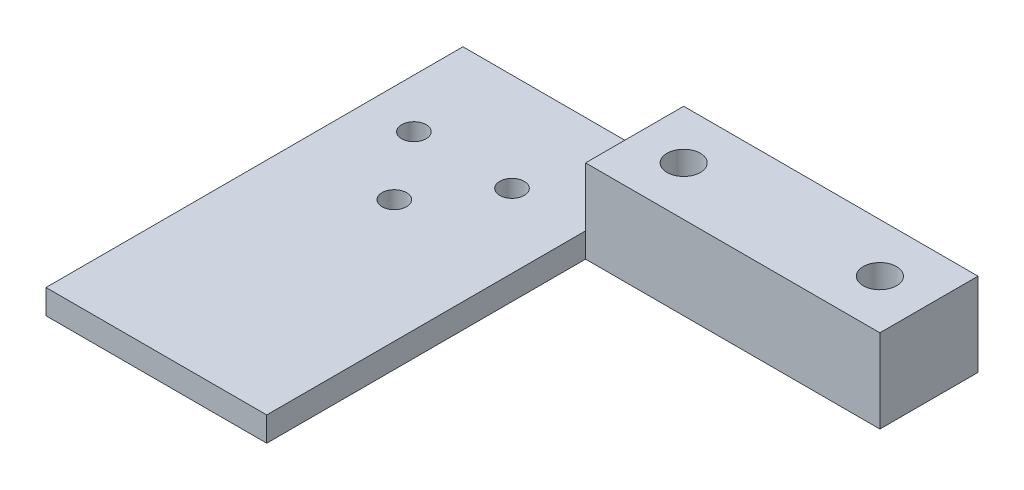
ISO-10303-21;
HEADER;
FILE_DESCRIPTION(('STEP AP214'),'2;1');
FILE_NAME('part.step','',(''),(''),'','','');
FILE_SCHEMA(('AUTOMOTIVE_DESIGN { 1 0 10303 214 1 1 1 1 }'));
ENDSEC;
DATA;
#1=APPLICATION_CONTEXT('core data for automotive mechanical design processes');
#2=APPLICATION_PROTOCOL_DEFINITION('international standard','automotive_design',2000,#1);
#3=PRODUCT_CONTEXT('',#1,'mechanical');
#4=PRODUCT('Part','Part','',(#3));
#5=PRODUCT_RELATED_PRODUCT_CATEGORY('part','',(#4));
#6=PRODUCT_DEFINITION_FORMATION('','',#4);
#7=PRODUCT_DEFINITION_CONTEXT('part definition',#1,'design');
#8=PRODUCT_DEFINITION('design','',#6,#7);
#9=PRODUCT_DEFINITION_SHAPE('','',#8);
#10=(LENGTH_UNIT() NAMED_UNIT(*) SI_UNIT(.MILLI.,.METRE.));
#11=(NAMED_UNIT(*) PLANE_ANGLE_UNIT() SI_UNIT($,.RADIAN.));
#12=(NAMED_UNIT(*) SI_UNIT($,.STERADIAN.) SOLID_ANGLE_UNIT());
#13=UNCERTAINTY_MEASURE_WITH_UNIT(LENGTH_MEASURE(1.E-05),#10,'distance_accuracy_value','');
#14=(GEOMETRIC_REPRESENTATION_CONTEXT(3) GLOBAL_UNCERTAINTY_ASSIGNED_CONTEXT((#13)) GLOBAL_UNIT_ASSIGNED_CONTEXT((#10,
#11,#12)) REPRESENTATION_CONTEXT('',''));
#15=CARTESIAN_POINT('',(0.,0.,0.));
#16=DIRECTION('',(0.,0.,1.));
#17=DIRECTION('',(1.,0.,0.));
#18=AXIS2_PLACEMENT_3D('',#15,#16,#17);
#19=CARTESIAN_POINT('',(-7.5,17.,42.5));
#20=DIRECTION('',(1.,0.,0.));
#21=DIRECTION('',(0.,0.,-1.));
#22=AXIS2_PLACEMENT_3D('',#19,#20,#21);
#23=PLANE('',#22);
#24=DIRECTION('',(0.,0.,1.));
#25=VECTOR('',#24,1.);
#26=CARTESIAN_POINT('',(-7.5,5.,0.));
#27=LINE('',#26,#25);
#28=CARTESIAN_POINT('',(-7.5,5.,-22.5));
#29=VERTEX_POINT('',#28);
#30=CARTESIAN_POINT('',(-7.5,5.,-42.5));
#31=VERTEX_POINT('',#30);
#32=EDGE_CURVE('E254',#29,#31,#27,.F.);
#33=ORIENTED_EDGE('',*,*,#32,.F.);
#34=DIRECTION('',(0.,1.,0.));
#35=VECTOR('',#34,1.);
#36=CARTESIAN_POINT('',(-7.5,0.,-22.5));
#37=LINE('',#36,#35);
#38=CARTESIAN_POINT('',(-7.5,17.,-22.5));
#39=VERTEX_POINT('',#38);
#40=EDGE_CURVE('E273',#39,#29,#37,.F.);
#41=ORIENTED_EDGE('',*,*,#40,.F.);
#42=DIRECTION('',(0.,0.,1.));
#43=VECTOR('',#42,1.);
#44=CARTESIAN_POINT('',(-7.5,17.,0.));
#45=LINE('',#44,#43);
#46=CARTESIAN_POINT('',(-7.5,17.,-42.5));
#47=VERTEX_POINT('',#46);
#48=EDGE_CURVE('E137',#47,#39,#45,.T.);
#49=ORIENTED_EDGE('',*,*,#48,.F.);
#50=DIRECTION('',(0.,1.,0.));
#51=VECTOR('',#50,1.);
#52=CARTESIAN_POINT('',(-7.5,0.,-42.5));
#53=LINE('',#52,#51);
#54=EDGE_CURVE('E280',#31,#47,#53,.T.);
#55=ORIENTED_EDGE('',*,*,#54,.F.);
#56=EDGE_LOOP('',(#33,#41,#49,#55));
#57=FACE_BOUND('',#56,.T.);
#58=ADVANCED_FACE('F17',(#57),#23,.F.);
#59=CARTESIAN_POINT('',(0.,17.,0.));
#60=DIRECTION('',(0.,1.,0.));
#61=DIRECTION('',(0.,0.,1.));
#62=AXIS2_PLACEMENT_3D('',#59,#60,#61);
#63=PLANE('',#62);
#64=CARTESIAN_POINT('',(2.5,17.,-32.5));
#65=DIRECTION('',(0.,1.,0.));
#66=DIRECTION('',(0.,0.,1.));
#67=AXIS2_PLACEMENT_3D('',#64,#65,#66);
#68=CIRCLE('',#67,3.4);
#69=CARTESIAN_POINT('',(2.5,17.,-29.1));
#70=VERTEX_POINT('',#69);
#71=EDGE_CURVE('E119',#70,#70,#68,.F.);
#72=ORIENTED_EDGE('',*,*,#71,.T.);
#73=EDGE_LOOP('',(#72));
#74=FACE_BOUND('',#73,.T.);
#75=CARTESIAN_POINT('',(42.5,17.,-32.5));
#76=DIRECTION('',(0.,1.,0.));
#77=DIRECTION('',(0.,0.,1.));
#78=AXIS2_PLACEMENT_3D('',#75,#76,#77);
#79=CIRCLE('',#78,3.4);
#80=CARTESIAN_POINT('',(42.5,17.,-29.1));
#81=VERTEX_POINT('',#80);
#82=EDGE_CURVE('E20',#81,#81,#79,.F.);
#83=ORIENTED_EDGE('',*,*,#82,.T.);
#84=EDGE_LOOP('',(#83));
#85=FACE_BOUND('',#84,.T.);
#86=DIRECTION('',(-1.,0.,0.));
#87=VECTOR('',#86,1.);
#88=CARTESIAN_POINT('',(52.5,17.,-42.5));
#89=LINE('',#88,#87);
#90=CARTESIAN_POINT('',(52.5,17.,-42.5));
#91=VERTEX_POINT('',#90);
#92=EDGE_CURVE('E282',#47,#91,#89,.F.);
#93=ORIENTED_EDGE('',*,*,#92,.F.);
#94=ORIENTED_EDGE('',*,*,#48,.T.);
#95=DIRECTION('',(1.,0.,0.));
#96=VECTOR('',#95,1.);
#97=CARTESIAN_POINT('',(-7.5,17.,-22.5));
#98=LINE('',#97,#96);
#99=CARTESIAN_POINT('',(52.5,17.,-22.5));
#100=VERTEX_POINT('',#99);
#101=EDGE_CURVE('E270',#100,#39,#98,.F.);
#102=ORIENTED_EDGE('',*,*,#101,.F.);
#103=DIRECTION('',(0.,0.,-1.));
#104=VECTOR('',#103,1.);
#105=CARTESIAN_POINT('',(52.5,17.,-22.5));
#106=LINE('',#105,#104);
#107=EDGE_CURVE('E276',#91,#100,#106,.F.);
#108=ORIENTED_EDGE('',*,*,#107,.F.);
#109=EDGE_LOOP('',(#93,#94,#102,#108));
#110=FACE_BOUND('',#109,.T.);
#111=ADVANCED_FACE('F166',(#74,#85,#110),#63,.T.);
#112=CARTESIAN_POINT('',(42.5,-0.895072409928,-32.5));
#113=DIRECTION('',(0.,1.,0.));
#114=DIRECTION('',(0.,0.,1.));
#115=AXIS2_PLACEMENT_3D('',#112,#113,#114);
#116=CYLINDRICAL_SURFACE('',#115,3.4);
#117=CARTESIAN_POINT('',(42.5,2.00000000000955,-32.5));
#118=DIRECTION('',(0.,1.,0.));
#119=DIRECTION('',(0.,0.,-1.));
#120=AXIS2_PLACEMENT_3D('',#117,#118,#119);
#121=CIRCLE('',#120,3.40000000002647);
#122=CARTESIAN_POINT('',(45.8999999999755,1.99999999998823,-32.5));
#123=VERTEX_POINT('',#122);
#124=CARTESIAN_POINT('',(39.1000000000194,1.99999999999295,-32.5));
#125=VERTEX_POINT('',#124);
#126=EDGE_CURVE('E123',#123,#125,#121,.F.);
#127=ORIENTED_EDGE('',*,*,#126,.T.);
#128=CARTESIAN_POINT('',(42.5,2.00000000000955,-32.5));
#129=DIRECTION('',(0.,1.,0.));
#130=DIRECTION('',(0.,0.,1.));
#131=AXIS2_PLACEMENT_3D('',#128,#129,#130);
#132=CIRCLE('',#131,3.39999999991505);
#133=EDGE_CURVE('E112',#125,#123,#132,.F.);
#134=ORIENTED_EDGE('',*,*,#133,.T.);
#135=EDGE_LOOP('',(#127,#134));
#136=FACE_BOUND('',#135,.T.);
#137=ORIENTED_EDGE('',*,*,#82,.F.);
#138=EDGE_LOOP('',(#137));
#139=FACE_BOUND('',#138,.T.);
#140=ADVANCED_FACE('F127',(#136,#139),#116,.F.);
#141=CARTESIAN_POINT('',(42.5,1.99999999995271,-32.5));
#142=DIRECTION('',(0.,1.,0.));
#143=DIRECTION('',(0.,0.,1.));
#144=AXIS2_PLACEMENT_3D('',#141,#142,#143);
#145=CONICAL_SURFACE('',#144,3.39999999985821,1.02974425867836);
#146=ORIENTED_EDGE('',*,*,#133,.F.);
#147=DIRECTION('',(0.857167300703852,-0.515038074907159,0.));
#148=VECTOR('',#147,1.);
#149=CARTESIAN_POINT('',(-498925.,299809.877996235,-32.5000000000305));
#150=LINE('',#149,#148);
#151=CARTESIAN_POINT('',(42.4285589646399,4.31584021992615E-11,-32.5));
#152=VERTEX_POINT('',#151);
#153=EDGE_CURVE('E116',#125,#152,#150,.T.);
#154=ORIENTED_EDGE('',*,*,#153,.T.);
#155=CARTESIAN_POINT('',(42.5,5.70884485517897E-11,-32.5));
#156=DIRECTION('',(0.,1.,0.));
#157=DIRECTION('',(0.,0.,1.));
#158=AXIS2_PLACEMENT_3D('',#155,#156,#157);
#159=CIRCLE('',#158,0.0714410353180039);
#160=CARTESIAN_POINT('',(42.5714410353317,4.31584021992615E-11,-32.5));
#161=VERTEX_POINT('',#160);
#162=EDGE_CURVE('E47',#161,#152,#159,.T.);
#163=ORIENTED_EDGE('',*,*,#162,.F.);
#164=DIRECTION('',(-0.857167300703852,-0.515038074907159,0.));
#165=VECTOR('',#164,1.);
#166=CARTESIAN_POINT('',(499010.,299809.877996235,-32.4999999999083));
#167=LINE('',#166,#165);
#168=EDGE_CURVE('E118',#161,#123,#167,.F.);
#169=ORIENTED_EDGE('',*,*,#168,.T.);
#170=EDGE_LOOP('',(#146,#154,#163,#169));
#171=FACE_BOUND('',#170,.T.);
#172=ADVANCED_FACE('F115',(#171),#145,.F.);
#173=CARTESIAN_POINT('',(2.5,-0.895072409928,-32.5));
#174=DIRECTION('',(0.,1.,0.));
#175=DIRECTION('',(0.,0.,1.));
#176=AXIS2_PLACEMENT_3D('',#173,#174,#175);
#177=CYLINDRICAL_SURFACE('',#176,3.4);
#178=CARTESIAN_POINT('',(2.5,2.00000000000955,-32.5));
#179=DIRECTION('',(0.,1.,0.));
#180=DIRECTION('',(0.,0.,-1.));
#181=AXIS2_PLACEMENT_3D('',#178,#179,#180);
#182=CIRCLE('',#181,3.40000000002647);
#183=CARTESIAN_POINT('',(5.89999999998461,1.99999999998823,-32.5));
#184=VERTEX_POINT('',#183);
#185=CARTESIAN_POINT('',(-0.899999999971533,1.99999999999295,-32.5));
#186=VERTEX_POINT('',#185);
#187=EDGE_CURVE('E242',#184,#186,#182,.F.);
#188=ORIENTED_EDGE('',*,*,#187,.T.);
#189=CARTESIAN_POINT('',(2.5,2.00000000000955,-32.5));
#190=DIRECTION('',(0.,1.,0.));
#191=DIRECTION('',(0.,0.,1.));
#192=AXIS2_PLACEMENT_3D('',#189,#190,#191);
#193=CIRCLE('',#192,3.39999999991505);
#194=EDGE_CURVE('E161',#186,#184,#193,.F.);
#195=ORIENTED_EDGE('',*,*,#194,.T.);
#196=EDGE_LOOP('',(#188,#195));
#197=FACE_BOUND('',#196,.T.);
#198=ORIENTED_EDGE('',*,*,#71,.F.);
#199=EDGE_LOOP('',(#198));
#200=FACE_BOUND('',#199,.T.);
#201=ADVANCED_FACE('F175',(#197,#200),#177,.F.);
#202=CARTESIAN_POINT('',(2.5,1.99999999995271,-32.5));
#203=DIRECTION('',(0.,1.,0.));
#204=DIRECTION('',(0.,0.,1.));
#205=AXIS2_PLACEMENT_3D('',#202,#203,#204);
#206=CONICAL_SURFACE('',#205,3.39999999985821,1.02974425867836);
#207=ORIENTED_EDGE('',*,*,#194,.F.);
#208=DIRECTION('',(0.857167300703852,-0.515038074907159,0.));
#209=VECTOR('',#208,1.);
#210=CARTESIAN_POINT('',(-498965.,299809.877996235,-32.5000000000306));
#211=LINE('',#210,#209);
#212=CARTESIAN_POINT('',(2.42855896471156,2.60807000995733E-11,-32.5));
#213=VERTEX_POINT('',#212);
#214=EDGE_CURVE('E159',#186,#213,#211,.T.);
#215=ORIENTED_EDGE('',*,*,#214,.T.);
#216=CARTESIAN_POINT('',(2.5,5.70884485517897E-11,-32.5));
#217=DIRECTION('',(0.,1.,0.));
#218=DIRECTION('',(0.,0.,1.));
#219=AXIS2_PLACEMENT_3D('',#216,#217,#218);
#220=CIRCLE('',#219,0.0714410353180039);
#221=CARTESIAN_POINT('',(2.57144103534529,2.60807000995733E-11,-32.5));
#222=VERTEX_POINT('',#221);
#223=EDGE_CURVE('E35',#222,#213,#220,.T.);
#224=ORIENTED_EDGE('',*,*,#223,.F.);
#225=DIRECTION('',(-0.857167300703852,-0.515038074907159,0.));
#226=VECTOR('',#225,1.);
#227=CARTESIAN_POINT('',(498970.,299809.877996235,-32.4999999999083));
#228=LINE('',#227,#226);
#229=EDGE_CURVE('E125',#222,#184,#228,.F.);
#230=ORIENTED_EDGE('',*,*,#229,.T.);
#231=EDGE_LOOP('',(#207,#215,#224,#230));
#232=FACE_BOUND('',#231,.T.);
#233=ADVANCED_FACE('F231',(#232),#206,.F.);
#234=CARTESIAN_POINT('',(0.,5.,0.));
#235=DIRECTION('',(0.,1.,0.));
#236=DIRECTION('',(0.,0.,1.));
#237=AXIS2_PLACEMENT_3D('',#234,#235,#236);
#238=PLANE('',#237);
#239=CARTESIAN_POINT('',(-32.5,5.,-8.5));
#240=DIRECTION('',(0.,-1.,0.));
#241=DIRECTION('',(0.,0.,-1.));
#242=AXIS2_PLACEMENT_3D('',#239,#240,#241);
#243=CIRCLE('',#242,2.5);
#244=CARTESIAN_POINT('',(-32.5,5.,-11.));
#245=VERTEX_POINT('',#244);
#246=EDGE_CURVE('E149',#245,#245,#243,.T.);
#247=ORIENTED_EDGE('',*,*,#246,.T.);
#248=EDGE_LOOP('',(#247));
#249=FACE_BOUND('',#248,.T.);
#250=CARTESIAN_POINT('',(-42.5,5.,-22.5));
#251=DIRECTION('',(0.,1.,0.));
#252=DIRECTION('',(0.,0.,1.));
#253=AXIS2_PLACEMENT_3D('',#250,#251,#252);
#254=CIRCLE('',#253,2.5);
#255=CARTESIAN_POINT('',(-42.5,5.,-20.));
#256=VERTEX_POINT('',#255);
#257=EDGE_CURVE('E153',#256,#256,#254,.F.);
#258=ORIENTED_EDGE('',*,*,#257,.T.);
#259=EDGE_LOOP('',(#258));
#260=FACE_BOUND('',#259,.T.);
#261=CARTESIAN_POINT('',(-22.5,5.,-22.5));
#262=DIRECTION('',(0.,1.,0.));
#263=DIRECTION('',(0.,0.,1.));
#264=AXIS2_PLACEMENT_3D('',#261,#262,#263);
#265=CIRCLE('',#264,2.5);
#266=CARTESIAN_POINT('',(-22.5,5.,-20.));
#267=VERTEX_POINT('',#266);
#268=EDGE_CURVE('E156',#267,#267,#265,.F.);
#269=ORIENTED_EDGE('',*,*,#268,.T.);
#270=EDGE_LOOP('',(#269));
#271=FACE_BOUND('',#270,.T.);
#272=DIRECTION('',(-1.,0.,0.));
#273=VECTOR('',#272,1.);
#274=CARTESIAN_POINT('',(52.5,5.,-42.5));
#275=LINE('',#274,#273);
#276=CARTESIAN_POINT('',(-52.5,5.,-42.5));
#277=VERTEX_POINT('',#276);
#278=EDGE_CURVE('E130',#277,#31,#275,.F.);
#279=ORIENTED_EDGE('',*,*,#278,.F.);
#280=DIRECTION('',(0.,0.,1.));
#281=VECTOR('',#280,1.);
#282=CARTESIAN_POINT('',(-52.5,5.,-42.5));
#283=LINE('',#282,#281);
#284=CARTESIAN_POINT('',(-52.5,5.,42.5));
#285=VERTEX_POINT('',#284);
#286=EDGE_CURVE('E256',#285,#277,#283,.F.);
#287=ORIENTED_EDGE('',*,*,#286,.F.);
#288=DIRECTION('',(1.,0.,0.));
#289=VECTOR('',#288,1.);
#290=CARTESIAN_POINT('',(-52.5,5.,42.5));
#291=LINE('',#290,#289);
#292=CARTESIAN_POINT('',(-7.5,5.,42.5));
#293=VERTEX_POINT('',#292);
#294=EDGE_CURVE('E260',#293,#285,#291,.F.);
#295=ORIENTED_EDGE('',*,*,#294,.F.);
#296=DIRECTION('',(0.,0.,-1.));
#297=VECTOR('',#296,1.);
#298=CARTESIAN_POINT('',(-7.5,5.,42.5));
#299=LINE('',#298,#297);
#300=EDGE_CURVE('E265',#29,#293,#299,.F.);
#301=ORIENTED_EDGE('',*,*,#300,.F.);
#302=ORIENTED_EDGE('',*,*,#32,.T.);
#303=EDGE_LOOP('',(#279,#287,#295,#301,#302));
#304=FACE_BOUND('',#303,.T.);
#305=ADVANCED_FACE('F227',(#249,#260,#271,#304),#238,.T.);
#306=CARTESIAN_POINT('',(-52.5,0.,-42.5));
#307=DIRECTION('',(-1.,0.,0.));
#308=DIRECTION('',(0.,0.,1.));
#309=AXIS2_PLACEMENT_3D('',#306,#307,#308);
#310=PLANE('',#309);
#311=DIRECTION('',(0.,1.,0.));
#312=VECTOR('',#311,1.);
#313=CARTESIAN_POINT('',(-52.5,0.,42.5));
#314=LINE('',#313,#312);
#315=CARTESIAN_POINT('',(-52.5,0.,42.5));
#316=VERTEX_POINT('',#315);
#317=EDGE_CURVE('E258',#285,#316,#314,.F.);
#318=ORIENTED_EDGE('',*,*,#317,.F.);
#319=ORIENTED_EDGE('',*,*,#286,.T.);
#320=DIRECTION('',(0.,1.,0.));
#321=VECTOR('',#320,1.);
#322=CARTESIAN_POINT('',(-52.5,0.,-42.5));
#323=LINE('',#322,#321);
#324=CARTESIAN_POINT('',(-52.5,0.,-42.5));
#325=VERTEX_POINT('',#324);
#326=EDGE_CURVE('E285',#325,#277,#323,.T.);
#327=ORIENTED_EDGE('',*,*,#326,.F.);
#328=DIRECTION('',(0.,0.,1.));
#329=VECTOR('',#328,1.);
#330=CARTESIAN_POINT('',(-52.5,0.,0.));
#331=LINE('',#330,#329);
#332=EDGE_CURVE('E152',#325,#316,#331,.T.);
#333=ORIENTED_EDGE('',*,*,#332,.T.);
#334=EDGE_LOOP('',(#318,#319,#327,#333));
#335=FACE_BOUND('',#334,.T.);
#336=ADVANCED_FACE('F223',(#335),#310,.T.);
#337=CARTESIAN_POINT('',(-52.5,0.,42.5));
#338=DIRECTION('',(0.,0.,1.));
#339=DIRECTION('',(1.,0.,0.));
#340=AXIS2_PLACEMENT_3D('',#337,#338,#339);
#341=PLANE('',#340);
#342=DIRECTION('',(0.,1.,0.));
#343=VECTOR('',#342,1.);
#344=CARTESIAN_POINT('',(-7.5,0.,42.5));
#345=LINE('',#344,#343);
#346=CARTESIAN_POINT('',(-7.5,0.,42.5));
#347=VERTEX_POINT('',#346);
#348=EDGE_CURVE('E263',#293,#347,#345,.F.);
#349=ORIENTED_EDGE('',*,*,#348,.F.);
#350=ORIENTED_EDGE('',*,*,#294,.T.);
#351=ORIENTED_EDGE('',*,*,#317,.T.);
#352=DIRECTION('',(1.,0.,0.));
#353=VECTOR('',#352,1.);
#354=CARTESIAN_POINT('',(0.,0.,42.5));
#355=LINE('',#354,#353);
#356=EDGE_CURVE('E300',#316,#347,#355,.T.);
#357=ORIENTED_EDGE('',*,*,#356,.T.);
#358=EDGE_LOOP('',(#349,#350,#351,#357));
#359=FACE_BOUND('',#358,.T.);
#360=ADVANCED_FACE('F219',(#359),#341,.T.);
#361=CARTESIAN_POINT('',(-7.5,0.,42.5));
#362=DIRECTION('',(1.,0.,0.));
#363=DIRECTION('',(0.,0.,-1.));
#364=AXIS2_PLACEMENT_3D('',#361,#362,#363);
#365=PLANE('',#364);
#366=DIRECTION('',(0.,1.,0.));
#367=VECTOR('',#366,1.);
#368=CARTESIAN_POINT('',(-7.5,0.,-22.5));
#369=LINE('',#368,#367);
#370=CARTESIAN_POINT('',(-7.5,0.,-22.5));
#371=VERTEX_POINT('',#370);
#372=EDGE_CURVE('E268',#29,#371,#369,.F.);
#373=ORIENTED_EDGE('',*,*,#372,.F.);
#374=ORIENTED_EDGE('',*,*,#300,.T.);
#375=ORIENTED_EDGE('',*,*,#348,.T.);
#376=DIRECTION('',(0.,0.,1.));
#377=VECTOR('',#376,1.);
#378=CARTESIAN_POINT('',(-7.5,0.,0.));
#379=LINE('',#378,#377);
#380=EDGE_CURVE('E303',#347,#371,#379,.F.);
#381=ORIENTED_EDGE('',*,*,#380,.T.);
#382=EDGE_LOOP('',(#373,#374,#375,#381));
#383=FACE_BOUND('',#382,.T.);
#384=ADVANCED_FACE('F215',(#383),#365,.T.);
#385=CARTESIAN_POINT('',(-7.5,0.,-22.5));
#386=DIRECTION('',(0.,0.,1.));
#387=DIRECTION('',(1.,0.,0.));
#388=AXIS2_PLACEMENT_3D('',#385,#386,#387);
#389=PLANE('',#388);
#390=ORIENTED_EDGE('',*,*,#101,.T.);
#391=ORIENTED_EDGE('',*,*,#40,.T.);
#392=ORIENTED_EDGE('',*,*,#372,.T.);
#393=DIRECTION('',(1.,0.,0.));
#394=VECTOR('',#393,1.);
#395=CARTESIAN_POINT('',(0.,0.,-22.5));
#396=LINE('',#395,#394);
#397=CARTESIAN_POINT('',(52.5,0.,-22.5));
#398=VERTEX_POINT('',#397);
#399=EDGE_CURVE('E306',#371,#398,#396,.T.);
#400=ORIENTED_EDGE('',*,*,#399,.T.);
#401=DIRECTION('',(0.,1.,0.));
#402=VECTOR('',#401,1.);
#403=CARTESIAN_POINT('',(52.5,0.,-22.5));
#404=LINE('',#403,#402);
#405=EDGE_CURVE('E278',#100,#398,#404,.F.);
#406=ORIENTED_EDGE('',*,*,#405,.F.);
#407=EDGE_LOOP('',(#390,#391,#392,#400,#406));
#408=FACE_BOUND('',#407,.T.);
#409=ADVANCED_FACE('F211',(#408),#389,.T.);
#410=CARTESIAN_POINT('',(52.5,0.,-22.5));
#411=DIRECTION('',(1.,0.,0.));
#412=DIRECTION('',(0.,0.,-1.));
#413=AXIS2_PLACEMENT_3D('',#410,#411,#412);
#414=PLANE('',#413);
#415=ORIENTED_EDGE('',*,*,#405,.T.);
#416=DIRECTION('',(0.,0.,1.));
#417=VECTOR('',#416,1.);
#418=CARTESIAN_POINT('',(52.5,0.,0.));
#419=LINE('',#418,#417);
#420=CARTESIAN_POINT('',(52.5,0.,-42.5));
#421=VERTEX_POINT('',#420);
#422=EDGE_CURVE('E309',#398,#421,#419,.F.);
#423=ORIENTED_EDGE('',*,*,#422,.T.);
#424=DIRECTION('',(0.,1.,0.));
#425=VECTOR('',#424,1.);
#426=CARTESIAN_POINT('',(52.5,0.,-42.5));
#427=LINE('',#426,#425);
#428=EDGE_CURVE('E59',#91,#421,#427,.F.);
#429=ORIENTED_EDGE('',*,*,#428,.F.);
#430=ORIENTED_EDGE('',*,*,#107,.T.);
#431=EDGE_LOOP('',(#415,#423,#429,#430));
#432=FACE_BOUND('',#431,.T.);
#433=ADVANCED_FACE('F208',(#432),#414,.T.);
#434=CARTESIAN_POINT('',(52.5,0.,-42.5));
#435=DIRECTION('',(0.,0.,-1.));
#436=DIRECTION('',(-1.,0.,0.));
#437=AXIS2_PLACEMENT_3D('',#434,#435,#436);
#438=PLANE('',#437);
#439=ORIENTED_EDGE('',*,*,#326,.T.);
#440=ORIENTED_EDGE('',*,*,#278,.T.);
#441=ORIENTED_EDGE('',*,*,#54,.T.);
#442=ORIENTED_EDGE('',*,*,#92,.T.);
#443=ORIENTED_EDGE('',*,*,#428,.T.);
#444=DIRECTION('',(1.,0.,0.));
#445=VECTOR('',#444,1.);
#446=CARTESIAN_POINT('',(0.,0.,-42.5));
#447=LINE('',#446,#445);
#448=EDGE_CURVE('E148',#421,#325,#447,.F.);
#449=ORIENTED_EDGE('',*,*,#448,.T.);
#450=EDGE_LOOP('',(#439,#440,#441,#442,#443,#449));
#451=FACE_BOUND('',#450,.T.);
#452=ADVANCED_FACE('F205',(#451),#438,.T.);
#453=CARTESIAN_POINT('',(42.5,1.99999999995271,-32.5));
#454=DIRECTION('',(0.,1.,0.));
#455=DIRECTION('',(0.,0.,1.));
#456=AXIS2_PLACEMENT_3D('',#453,#454,#455);
#457=CONICAL_SURFACE('',#456,3.39999999996962,1.02974425869091);
#458=ORIENTED_EDGE('',*,*,#126,.F.);
#459=ORIENTED_EDGE('',*,*,#168,.F.);
#460=CARTESIAN_POINT('',(42.5,2.92283558467332E-11,-32.5));
#461=DIRECTION('',(0.,1.,0.));
#462=DIRECTION('',(0.,0.,1.));
#463=AXIS2_PLACEMENT_3D('',#460,#461,#462);
#464=CIRCLE('',#463,0.0714410352884443);
#465=EDGE_CURVE('E124',#161,#152,#464,.F.);
#466=ORIENTED_EDGE('',*,*,#465,.T.);
#467=ORIENTED_EDGE('',*,*,#153,.F.);
#468=EDGE_LOOP('',(#458,#459,#466,#467));
#469=FACE_BOUND('',#468,.T.);
#470=ADVANCED_FACE('F122',(#469),#457,.F.);
#471=CARTESIAN_POINT('',(2.5,1.99999999995271,-32.5));
#472=DIRECTION('',(0.,1.,0.));
#473=DIRECTION('',(0.,0.,1.));
#474=AXIS2_PLACEMENT_3D('',#471,#472,#473);
#475=CONICAL_SURFACE('',#474,3.39999999996962,1.02974425869091);
#476=ORIENTED_EDGE('',*,*,#187,.F.);
#477=ORIENTED_EDGE('',*,*,#229,.F.);
#478=CARTESIAN_POINT('',(2.5,-4.92704835264313E-12,-32.5));
#479=DIRECTION('',(0.,1.,0.));
#480=DIRECTION('',(0.,0.,1.));
#481=AXIS2_PLACEMENT_3D('',#478,#479,#480);
#482=CIRCLE('',#481,0.0714410352316008);
#483=EDGE_CURVE('E144',#222,#213,#482,.F.);
#484=ORIENTED_EDGE('',*,*,#483,.T.);
#485=ORIENTED_EDGE('',*,*,#214,.F.);
#486=EDGE_LOOP('',(#476,#477,#484,#485));
#487=FACE_BOUND('',#486,.T.);
#488=ADVANCED_FACE('F198',(#487),#475,.F.);
#489=CARTESIAN_POINT('',(-22.5,-7.07725912495,-22.5));
#490=DIRECTION('',(0.,1.,0.));
#491=DIRECTION('',(0.,0.,1.));
#492=AXIS2_PLACEMENT_3D('',#489,#490,#491);
#493=CYLINDRICAL_SURFACE('',#492,2.5);
#494=ORIENTED_EDGE('',*,*,#268,.F.);
#495=EDGE_LOOP('',(#494));
#496=FACE_BOUND('',#495,.T.);
#497=CARTESIAN_POINT('',(-22.5,0.,-22.5));
#498=DIRECTION('',(0.,1.,0.));
#499=DIRECTION('',(0.,0.,1.));
#500=AXIS2_PLACEMENT_3D('',#497,#498,#499);
#501=CIRCLE('',#500,2.5);
#502=CARTESIAN_POINT('',(-22.5,0.,-20.));
#503=VERTEX_POINT('',#502);
#504=EDGE_CURVE('E141',#503,#503,#501,.F.);
#505=ORIENTED_EDGE('',*,*,#504,.T.);
#506=EDGE_LOOP('',(#505));
#507=FACE_BOUND('',#506,.T.);
#508=ADVANCED_FACE('F194',(#496,#507),#493,.F.);
#509=CARTESIAN_POINT('',(-42.5,-7.07725912495,-22.5));
#510=DIRECTION('',(0.,1.,0.));
#511=DIRECTION('',(0.,0.,1.));
#512=AXIS2_PLACEMENT_3D('',#509,#510,#511);
#513=CYLINDRICAL_SURFACE('',#512,2.5);
#514=ORIENTED_EDGE('',*,*,#257,.F.);
#515=EDGE_LOOP('',(#514));
#516=FACE_BOUND('',#515,.T.);
#517=CARTESIAN_POINT('',(-42.5,0.,-22.5));
#518=DIRECTION('',(0.,1.,0.));
#519=DIRECTION('',(0.,0.,1.));
#520=AXIS2_PLACEMENT_3D('',#517,#518,#519);
#521=CIRCLE('',#520,2.5);
#522=CARTESIAN_POINT('',(-42.5,0.,-20.));
#523=VERTEX_POINT('',#522);
#524=EDGE_CURVE('E26',#523,#523,#521,.F.);
#525=ORIENTED_EDGE('',*,*,#524,.T.);
#526=EDGE_LOOP('',(#525));
#527=FACE_BOUND('',#526,.T.);
#528=ADVANCED_FACE('F186',(#516,#527),#513,.F.);
#529=CARTESIAN_POINT('',(-32.5,15.,-8.5));
#530=DIRECTION('',(0.,-1.,0.));
#531=DIRECTION('',(0.,0.,-1.));
#532=AXIS2_PLACEMENT_3D('',#529,#530,#531);
#533=CYLINDRICAL_SURFACE('',#532,2.5);
#534=CARTESIAN_POINT('',(-32.5,0.,-8.5));
#535=DIRECTION('',(0.,-1.,0.));
#536=DIRECTION('',(0.,0.,-1.));
#537=AXIS2_PLACEMENT_3D('',#534,#535,#536);
#538=CIRCLE('',#537,2.5);
#539=CARTESIAN_POINT('',(-32.5,0.,-11.));
#540=VERTEX_POINT('',#539);
#541=EDGE_CURVE('E11',#540,#540,#538,.T.);
#542=ORIENTED_EDGE('',*,*,#541,.T.);
#543=EDGE_LOOP('',(#542));
#544=FACE_BOUND('',#543,.T.);
#545=ORIENTED_EDGE('',*,*,#246,.F.);
#546=EDGE_LOOP('',(#545));
#547=FACE_BOUND('',#546,.T.);
#548=ADVANCED_FACE('F180',(#544,#547),#533,.F.);
#549=CARTESIAN_POINT('',(0.,0.,0.));
#550=DIRECTION('',(0.,1.,0.));
#551=DIRECTION('',(0.,0.,1.));
#552=AXIS2_PLACEMENT_3D('',#549,#550,#551);
#553=PLANE('',#552);
#554=ORIENTED_EDGE('',*,*,#541,.F.);
#555=EDGE_LOOP('',(#554));
#556=FACE_BOUND('',#555,.T.);
#557=ORIENTED_EDGE('',*,*,#524,.F.);
#558=EDGE_LOOP('',(#557));
#559=FACE_BOUND('',#558,.T.);
#560=ORIENTED_EDGE('',*,*,#504,.F.);
#561=EDGE_LOOP('',(#560));
#562=FACE_BOUND('',#561,.T.);
#563=ORIENTED_EDGE('',*,*,#223,.T.);
#564=ORIENTED_EDGE('',*,*,#483,.F.);
#565=EDGE_LOOP('',(#563,#564));
#566=FACE_BOUND('',#565,.T.);
#567=ORIENTED_EDGE('',*,*,#162,.T.);
#568=ORIENTED_EDGE('',*,*,#465,.F.);
#569=EDGE_LOOP('',(#567,#568));
#570=FACE_BOUND('',#569,.T.);
#571=ORIENTED_EDGE('',*,*,#422,.F.);
#572=ORIENTED_EDGE('',*,*,#399,.F.);
#573=ORIENTED_EDGE('',*,*,#380,.F.);
#574=ORIENTED_EDGE('',*,*,#356,.F.);
#575=ORIENTED_EDGE('',*,*,#332,.F.);
#576=ORIENTED_EDGE('',*,*,#448,.F.);
#577=EDGE_LOOP('',(#571,#572,#573,#574,#575,#576));
#578=FACE_BOUND('',#577,.T.);
#579=ADVANCED_FACE('F178',(#556,#559,#562,#566,#570,#578),#553,.F.);
#580=CLOSED_SHELL('',(#58,#111,#140,#172,#201,#233,#305,#336,#360,#384,#409,#433,#452,#470,#488,
#508,#528,#548,#579));
#581=MANIFOLD_SOLID_BREP('B1',#580);
#582=ADVANCED_BREP_SHAPE_REPRESENTATION('',(#18,#581),#14);
#583=SHAPE_DEFINITION_REPRESENTATION(#9,#582);
ENDSEC;
END-ISO-10303-21;
